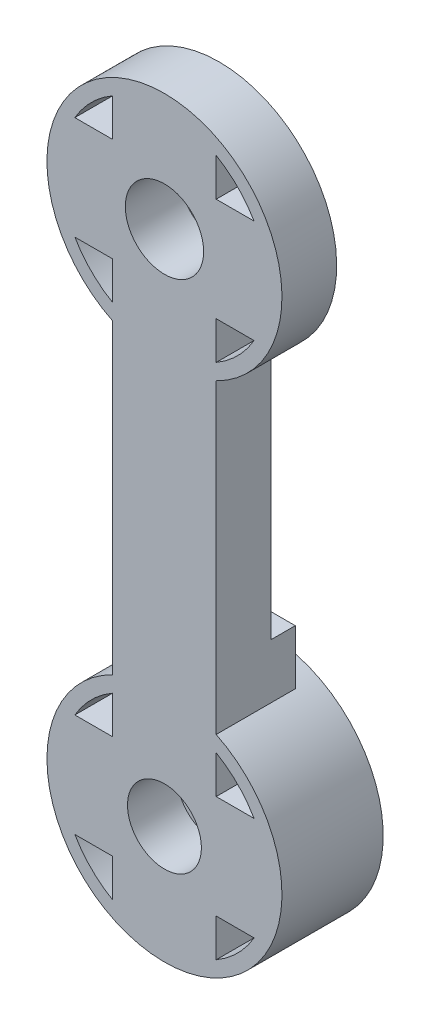
ISO-10303-21;
HEADER;
FILE_DESCRIPTION(('STEP AP214'),'2;1');
FILE_NAME('part.step','',(''),(''),'','','');
FILE_SCHEMA(('AUTOMOTIVE_DESIGN { 1 0 10303 214 1 1 1 1 }'));
ENDSEC;
DATA;
#1=APPLICATION_CONTEXT('core data for automotive mechanical design processes');
#2=APPLICATION_PROTOCOL_DEFINITION('international standard','automotive_design',2000,#1);
#3=PRODUCT_CONTEXT('',#1,'mechanical');
#4=PRODUCT('Part','Part','',(#3));
#5=PRODUCT_RELATED_PRODUCT_CATEGORY('part','',(#4));
#6=PRODUCT_DEFINITION_FORMATION('','',#4);
#7=PRODUCT_DEFINITION_CONTEXT('part definition',#1,'design');
#8=PRODUCT_DEFINITION('design','',#6,#7);
#9=PRODUCT_DEFINITION_SHAPE('','',#8);
#10=(LENGTH_UNIT() NAMED_UNIT(*) SI_UNIT(.MILLI.,.METRE.));
#11=(NAMED_UNIT(*) PLANE_ANGLE_UNIT() SI_UNIT($,.RADIAN.));
#12=(NAMED_UNIT(*) SI_UNIT($,.STERADIAN.) SOLID_ANGLE_UNIT());
#13=UNCERTAINTY_MEASURE_WITH_UNIT(LENGTH_MEASURE(1.E-05),#10,'distance_accuracy_value','');
#14=(GEOMETRIC_REPRESENTATION_CONTEXT(3) GLOBAL_UNCERTAINTY_ASSIGNED_CONTEXT((#13)) GLOBAL_UNIT_ASSIGNED_CONTEXT((#10,
#11,#12)) REPRESENTATION_CONTEXT('',''));
#15=CARTESIAN_POINT('',(0.,0.,0.));
#16=DIRECTION('',(0.,0.,1.));
#17=DIRECTION('',(1.,0.,0.));
#18=AXIS2_PLACEMENT_3D('',#15,#16,#17);
#19=CARTESIAN_POINT('',(0.,-35.,3.));
#20=DIRECTION('',(0.,0.,-1.));
#21=DIRECTION('',(-1.,0.,0.));
#22=AXIS2_PLACEMENT_3D('',#19,#20,#21);
#23=CYLINDRICAL_SURFACE('',#22,7.95);
#24=CARTESIAN_POINT('',(0.,-35.,-3.85));
#25=DIRECTION('',(0.,0.,-1.));
#26=DIRECTION('',(-1.,0.,0.));
#27=AXIS2_PLACEMENT_3D('',#24,#25,#26);
#28=CIRCLE('',#27,7.95);
#29=CARTESIAN_POINT('',(-7.95,-35.,-3.85));
#30=VERTEX_POINT('',#29);
#31=EDGE_CURVE('E285',#30,#30,#28,.T.);
#32=ORIENTED_EDGE('',*,*,#31,.F.);
#33=EDGE_LOOP('',(#32));
#34=FACE_BOUND('',#33,.T.);
#35=CARTESIAN_POINT('',(0.,-35.,-2.35));
#36=DIRECTION('',(0.,0.,-1.));
#37=DIRECTION('',(-1.,0.,0.));
#38=AXIS2_PLACEMENT_3D('',#35,#36,#37);
#39=CIRCLE('',#38,7.95);
#40=CARTESIAN_POINT('',(3.5,-27.8618980113759,-2.35));
#41=VERTEX_POINT('',#40);
#42=CARTESIAN_POINT('',(-3.5,-27.8618980113759,-2.35));
#43=VERTEX_POINT('',#42);
#44=EDGE_CURVE('E267',#41,#43,#39,.F.);
#45=ORIENTED_EDGE('',*,*,#44,.F.);
#46=DIRECTION('',(0.,0.,-1.));
#47=VECTOR('',#46,1.);
#48=CARTESIAN_POINT('',(3.5,-27.8618980113759,3.));
#49=LINE('',#48,#47);
#50=CARTESIAN_POINT('',(3.5,-27.8618980113759,3.));
#51=VERTEX_POINT('',#50);
#52=EDGE_CURVE('E248',#51,#41,#49,.T.);
#53=ORIENTED_EDGE('',*,*,#52,.F.);
#54=CARTESIAN_POINT('',(0.,-35.,3.));
#55=DIRECTION('',(0.,0.,1.));
#56=DIRECTION('',(1.,0.,0.));
#57=AXIS2_PLACEMENT_3D('',#54,#55,#56);
#58=CIRCLE('',#57,7.95);
#59=CARTESIAN_POINT('',(-3.5,-27.8618980113759,3.));
#60=VERTEX_POINT('',#59);
#61=EDGE_CURVE('E427',#51,#60,#58,.F.);
#62=ORIENTED_EDGE('',*,*,#61,.T.);
#63=DIRECTION('',(0.,0.,-1.));
#64=VECTOR('',#63,1.);
#65=CARTESIAN_POINT('',(-3.5,-27.8618980113759,3.));
#66=LINE('',#65,#64);
#67=EDGE_CURVE('E259',#60,#43,#66,.T.);
#68=ORIENTED_EDGE('',*,*,#67,.T.);
#69=EDGE_LOOP('',(#45,#53,#62,#68));
#70=FACE_BOUND('',#69,.T.);
#71=ADVANCED_FACE('F47',(#34,#70),#23,.T.);
#72=CARTESIAN_POINT('',(0.,0.,-0.7));
#73=DIRECTION('',(0.,0.,-1.));
#74=DIRECTION('',(-1.,0.,0.));
#75=AXIS2_PLACEMENT_3D('',#72,#73,#74);
#76=PLANE('',#75);
#77=CARTESIAN_POINT('',(0.,0.,-0.7));
#78=DIRECTION('',(0.,0.,-1.));
#79=DIRECTION('',(-1.,0.,0.));
#80=AXIS2_PLACEMENT_3D('',#77,#78,#79);
#81=CIRCLE('',#80,2.65);
#82=CARTESIAN_POINT('',(-2.65,0.,-0.7));
#83=VERTEX_POINT('',#82);
#84=EDGE_CURVE('E341',#83,#83,#81,.T.);
#85=ORIENTED_EDGE('',*,*,#84,.F.);
#86=EDGE_LOOP('',(#85));
#87=FACE_BOUND('',#86,.T.);
#88=DIRECTION('',(0.,1.,0.));
#89=VECTOR('',#88,1.);
#90=CARTESIAN_POINT('',(-3.5,0.,-0.7));
#91=LINE('',#90,#89);
#92=CARTESIAN_POINT('',(-3.5,3.5,-0.7));
#93=VERTEX_POINT('',#92);
#94=CARTESIAN_POINT('',(-3.5,6.06217782649107,-0.7));
#95=VERTEX_POINT('',#94);
#96=EDGE_CURVE('E376',#93,#95,#91,.T.);
#97=ORIENTED_EDGE('',*,*,#96,.T.);
#98=CARTESIAN_POINT('',(0.,0.,-0.7));
#99=DIRECTION('',(0.,0.,1.));
#100=DIRECTION('',(1.,0.,0.));
#101=AXIS2_PLACEMENT_3D('',#98,#99,#100);
#102=CIRCLE('',#101,7.);
#103=CARTESIAN_POINT('',(-6.06217782649107,3.5,-0.7));
#104=VERTEX_POINT('',#103);
#105=EDGE_CURVE('E375',#95,#104,#102,.T.);
#106=ORIENTED_EDGE('',*,*,#105,.T.);
#107=DIRECTION('',(-1.,0.,0.));
#108=VECTOR('',#107,1.);
#109=CARTESIAN_POINT('',(0.,3.5,-0.7));
#110=LINE('',#109,#108);
#111=EDGE_CURVE('E379',#93,#104,#110,.T.);
#112=ORIENTED_EDGE('',*,*,#111,.F.);
#113=EDGE_LOOP('',(#97,#106,#112));
#114=FACE_BOUND('',#113,.T.);
#115=DIRECTION('',(0.,-1.,0.));
#116=VECTOR('',#115,1.);
#117=CARTESIAN_POINT('',(3.5,0.,-0.7));
#118=LINE('',#117,#116);
#119=CARTESIAN_POINT('',(3.5,-3.5,-0.7));
#120=VERTEX_POINT('',#119);
#121=CARTESIAN_POINT('',(3.5,-6.06217782649107,-0.7));
#122=VERTEX_POINT('',#121);
#123=EDGE_CURVE('E73',#120,#122,#118,.T.);
#124=ORIENTED_EDGE('',*,*,#123,.T.);
#125=CARTESIAN_POINT('',(6.06217782649107,-3.5,-0.7));
#126=VERTEX_POINT('',#125);
#127=EDGE_CURVE('E357',#122,#126,#102,.T.);
#128=ORIENTED_EDGE('',*,*,#127,.T.);
#129=DIRECTION('',(1.,0.,0.));
#130=VECTOR('',#129,1.);
#131=CARTESIAN_POINT('',(0.,-3.5,-0.7));
#132=LINE('',#131,#130);
#133=EDGE_CURVE('E360',#120,#126,#132,.T.);
#134=ORIENTED_EDGE('',*,*,#133,.F.);
#135=EDGE_LOOP('',(#124,#128,#134));
#136=FACE_BOUND('',#135,.T.);
#137=DIRECTION('',(-1.,0.,0.));
#138=VECTOR('',#137,1.);
#139=CARTESIAN_POINT('',(0.,-3.5,-0.7));
#140=LINE('',#139,#138);
#141=CARTESIAN_POINT('',(-3.5,-3.5,-0.7));
#142=VERTEX_POINT('',#141);
#143=CARTESIAN_POINT('',(-6.06217782649107,-3.5,-0.7));
#144=VERTEX_POINT('',#143);
#145=EDGE_CURVE('E372',#142,#144,#140,.T.);
#146=ORIENTED_EDGE('',*,*,#145,.T.);
#147=CARTESIAN_POINT('',(-3.5,-6.06217782649107,-0.7));
#148=VERTEX_POINT('',#147);
#149=EDGE_CURVE('E362',#144,#148,#102,.T.);
#150=ORIENTED_EDGE('',*,*,#149,.T.);
#151=DIRECTION('',(0.,-1.,0.));
#152=VECTOR('',#151,1.);
#153=CARTESIAN_POINT('',(-3.5,0.,-0.7));
#154=LINE('',#153,#152);
#155=EDGE_CURVE('E368',#142,#148,#154,.T.);
#156=ORIENTED_EDGE('',*,*,#155,.F.);
#157=EDGE_LOOP('',(#146,#150,#156));
#158=FACE_BOUND('',#157,.T.);
#159=DIRECTION('',(1.,0.,0.));
#160=VECTOR('',#159,1.);
#161=CARTESIAN_POINT('',(0.,3.5,-0.7));
#162=LINE('',#161,#160);
#163=CARTESIAN_POINT('',(3.5,3.5,-0.7));
#164=VERTEX_POINT('',#163);
#165=CARTESIAN_POINT('',(6.06217782649107,3.5,-0.7));
#166=VERTEX_POINT('',#165);
#167=EDGE_CURVE('E387',#164,#166,#162,.T.);
#168=ORIENTED_EDGE('',*,*,#167,.T.);
#169=CARTESIAN_POINT('',(3.5,6.06217782649107,-0.7));
#170=VERTEX_POINT('',#169);
#171=EDGE_CURVE('E361',#166,#170,#102,.T.);
#172=ORIENTED_EDGE('',*,*,#171,.T.);
#173=DIRECTION('',(0.,1.,0.));
#174=VECTOR('',#173,1.);
#175=CARTESIAN_POINT('',(3.5,0.,-0.7));
#176=LINE('',#175,#174);
#177=EDGE_CURVE('E383',#164,#170,#176,.T.);
#178=ORIENTED_EDGE('',*,*,#177,.F.);
#179=EDGE_LOOP('',(#168,#172,#178));
#180=FACE_BOUND('',#179,.T.);
#181=DIRECTION('',(0.,-1.,0.));
#182=VECTOR('',#181,1.);
#183=CARTESIAN_POINT('',(3.5,0.,-0.7));
#184=LINE('',#183,#182);
#185=CARTESIAN_POINT('',(3.5,-7.13810198862415,-0.7));
#186=VERTEX_POINT('',#185);
#187=CARTESIAN_POINT('',(3.5,-24.1618980113759,-0.7));
#188=VERTEX_POINT('',#187);
#189=EDGE_CURVE('E390',#186,#188,#184,.T.);
#190=ORIENTED_EDGE('',*,*,#189,.T.);
#191=DIRECTION('',(-1.,0.,0.));
#192=VECTOR('',#191,1.);
#193=CARTESIAN_POINT('',(0.,-24.1618980113759,-0.7));
#194=LINE('',#193,#192);
#195=CARTESIAN_POINT('',(-3.5,-24.1618980113759,-0.7));
#196=VERTEX_POINT('',#195);
#197=EDGE_CURVE('E345',#188,#196,#194,.T.);
#198=ORIENTED_EDGE('',*,*,#197,.T.);
#199=DIRECTION('',(0.,1.,0.));
#200=VECTOR('',#199,1.);
#201=CARTESIAN_POINT('',(-3.5,0.,-0.7));
#202=LINE('',#201,#200);
#203=CARTESIAN_POINT('',(-3.5,-7.13810198862415,-0.7));
#204=VERTEX_POINT('',#203);
#205=EDGE_CURVE('E394',#196,#204,#202,.T.);
#206=ORIENTED_EDGE('',*,*,#205,.T.);
#207=CARTESIAN_POINT('',(0.,0.,-0.7));
#208=DIRECTION('',(0.,0.,1.));
#209=DIRECTION('',(1.,0.,0.));
#210=AXIS2_PLACEMENT_3D('',#207,#208,#209);
#211=CIRCLE('',#210,7.95);
#212=EDGE_CURVE('E353',#186,#204,#211,.T.);
#213=ORIENTED_EDGE('',*,*,#212,.F.);
#214=EDGE_LOOP('',(#190,#198,#206,#213));
#215=FACE_BOUND('',#214,.T.);
#216=ADVANCED_FACE('F650',(#87,#114,#136,#158,#180,#215),#76,.T.);
#217=CARTESIAN_POINT('',(0.,0.,3.));
#218=DIRECTION('',(0.,0.,-1.));
#219=DIRECTION('',(-1.,0.,0.));
#220=AXIS2_PLACEMENT_3D('',#217,#218,#219);
#221=CYLINDRICAL_SURFACE('',#220,7.);
#222=ORIENTED_EDGE('',*,*,#171,.F.);
#223=DIRECTION('',(0.,0.,-1.));
#224=VECTOR('',#223,1.);
#225=CARTESIAN_POINT('',(6.06217782649107,3.5,3.));
#226=LINE('',#225,#224);
#227=CARTESIAN_POINT('',(6.06217782649107,3.5,3.));
#228=VERTEX_POINT('',#227);
#229=EDGE_CURVE('E11',#228,#166,#226,.T.);
#230=ORIENTED_EDGE('',*,*,#229,.F.);
#231=CARTESIAN_POINT('',(0.,0.,3.));
#232=DIRECTION('',(0.,0.,1.));
#233=DIRECTION('',(1.,0.,0.));
#234=AXIS2_PLACEMENT_3D('',#231,#232,#233);
#235=CIRCLE('',#234,7.);
#236=CARTESIAN_POINT('',(3.5,6.06217782649107,3.));
#237=VERTEX_POINT('',#236);
#238=EDGE_CURVE('E485',#228,#237,#235,.T.);
#239=ORIENTED_EDGE('',*,*,#238,.T.);
#240=DIRECTION('',(0.,0.,-1.));
#241=VECTOR('',#240,1.);
#242=CARTESIAN_POINT('',(3.5,6.06217782649107,3.));
#243=LINE('',#242,#241);
#244=EDGE_CURVE('E497',#237,#170,#243,.T.);
#245=ORIENTED_EDGE('',*,*,#244,.T.);
#246=EDGE_LOOP('',(#222,#230,#239,#245));
#247=FACE_BOUND('',#246,.T.);
#248=ADVANCED_FACE('F641',(#247),#221,.F.);
#249=ORIENTED_EDGE('',*,*,#105,.F.);
#250=DIRECTION('',(0.,0.,-1.));
#251=VECTOR('',#250,1.);
#252=CARTESIAN_POINT('',(-3.5,6.06217782649107,3.));
#253=LINE('',#252,#251);
#254=CARTESIAN_POINT('',(-3.5,6.06217782649107,3.));
#255=VERTEX_POINT('',#254);
#256=EDGE_CURVE('E509',#255,#95,#253,.T.);
#257=ORIENTED_EDGE('',*,*,#256,.F.);
#258=CARTESIAN_POINT('',(-6.06217782649107,3.5,3.));
#259=VERTEX_POINT('',#258);
#260=EDGE_CURVE('E480',#255,#259,#235,.T.);
#261=ORIENTED_EDGE('',*,*,#260,.T.);
#262=DIRECTION('',(0.,0.,-1.));
#263=VECTOR('',#262,1.);
#264=CARTESIAN_POINT('',(-6.06217782649107,3.5,3.));
#265=LINE('',#264,#263);
#266=EDGE_CURVE('E501',#259,#104,#265,.T.);
#267=ORIENTED_EDGE('',*,*,#266,.T.);
#268=EDGE_LOOP('',(#249,#257,#261,#267));
#269=FACE_BOUND('',#268,.T.);
#270=ADVANCED_FACE('F1038',(#269),#221,.F.);
#271=ORIENTED_EDGE('',*,*,#149,.F.);
#272=DIRECTION('',(0.,0.,-1.));
#273=VECTOR('',#272,1.);
#274=CARTESIAN_POINT('',(-6.06217782649107,-3.5,3.));
#275=LINE('',#274,#273);
#276=CARTESIAN_POINT('',(-6.06217782649107,-3.5,3.));
#277=VERTEX_POINT('',#276);
#278=EDGE_CURVE('E517',#277,#144,#275,.T.);
#279=ORIENTED_EDGE('',*,*,#278,.F.);
#280=CARTESIAN_POINT('',(0.,0.,3.));
#281=DIRECTION('',(0.,0.,1.));
#282=DIRECTION('',(1.,0.,0.));
#283=AXIS2_PLACEMENT_3D('',#280,#281,#282);
#284=CIRCLE('',#283,7.);
#285=CARTESIAN_POINT('',(-3.5,-6.06217782649107,3.));
#286=VERTEX_POINT('',#285);
#287=EDGE_CURVE('E473',#277,#286,#284,.T.);
#288=ORIENTED_EDGE('',*,*,#287,.T.);
#289=DIRECTION('',(0.,0.,-1.));
#290=VECTOR('',#289,1.);
#291=CARTESIAN_POINT('',(-3.5,-6.06217782649107,3.));
#292=LINE('',#291,#290);
#293=EDGE_CURVE('E521',#286,#148,#292,.T.);
#294=ORIENTED_EDGE('',*,*,#293,.T.);
#295=EDGE_LOOP('',(#271,#279,#288,#294));
#296=FACE_BOUND('',#295,.T.);
#297=ADVANCED_FACE('F657',(#296),#221,.F.);
#298=CARTESIAN_POINT('',(0.,0.,3.));
#299=DIRECTION('',(0.,0.,-1.));
#300=DIRECTION('',(-1.,0.,0.));
#301=AXIS2_PLACEMENT_3D('',#298,#299,#300);
#302=CYLINDRICAL_SURFACE('',#301,7.95);
#303=ORIENTED_EDGE('',*,*,#212,.T.);
#304=DIRECTION('',(0.,0.,-1.));
#305=VECTOR('',#304,1.);
#306=CARTESIAN_POINT('',(-3.5,-7.13810198862415,3.));
#307=LINE('',#306,#305);
#308=CARTESIAN_POINT('',(-3.5,-7.13810198862415,3.));
#309=VERTEX_POINT('',#308);
#310=EDGE_CURVE('E558',#309,#204,#307,.T.);
#311=ORIENTED_EDGE('',*,*,#310,.F.);
#312=CARTESIAN_POINT('',(0.,0.,3.));
#313=DIRECTION('',(0.,0.,1.));
#314=DIRECTION('',(1.,0.,0.));
#315=AXIS2_PLACEMENT_3D('',#312,#313,#314);
#316=CIRCLE('',#315,7.95);
#317=CARTESIAN_POINT('',(3.5,-7.13810198862415,3.));
#318=VERTEX_POINT('',#317);
#319=EDGE_CURVE('E432',#318,#309,#316,.T.);
#320=ORIENTED_EDGE('',*,*,#319,.F.);
#321=DIRECTION('',(0.,0.,-1.));
#322=VECTOR('',#321,1.);
#323=CARTESIAN_POINT('',(3.5,-7.13810198862415,3.));
#324=LINE('',#323,#322);
#325=EDGE_CURVE('E260',#318,#186,#324,.T.);
#326=ORIENTED_EDGE('',*,*,#325,.T.);
#327=EDGE_LOOP('',(#303,#311,#320,#326));
#328=FACE_BOUND('',#327,.T.);
#329=ADVANCED_FACE('F766',(#328),#302,.T.);
#330=CARTESIAN_POINT('',(0.,-35.,3.));
#331=DIRECTION('',(0.,0.,-1.));
#332=DIRECTION('',(-1.,0.,0.));
#333=AXIS2_PLACEMENT_3D('',#330,#331,#332);
#334=CYLINDRICAL_SURFACE('',#333,1.5);
#335=CARTESIAN_POINT('',(0.,-35.,-0.35));
#336=DIRECTION('',(0.,0.,1.));
#337=DIRECTION('',(1.,0.,0.));
#338=AXIS2_PLACEMENT_3D('',#335,#336,#337);
#339=CIRCLE('',#338,1.5);
#340=CARTESIAN_POINT('',(1.5,-35.,-0.35));
#341=VERTEX_POINT('',#340);
#342=EDGE_CURVE('E51',#341,#341,#339,.F.);
#343=ORIENTED_EDGE('',*,*,#342,.F.);
#344=EDGE_LOOP('',(#343));
#345=FACE_BOUND('',#344,.T.);
#346=CARTESIAN_POINT('',(0.,-35.,-3.85));
#347=DIRECTION('',(0.,0.,-1.));
#348=DIRECTION('',(-1.,0.,0.));
#349=AXIS2_PLACEMENT_3D('',#346,#347,#348);
#350=CIRCLE('',#349,1.5);
#351=CARTESIAN_POINT('',(-1.5,-35.,-3.85));
#352=VERTEX_POINT('',#351);
#353=EDGE_CURVE('E281',#352,#352,#350,.F.);
#354=ORIENTED_EDGE('',*,*,#353,.F.);
#355=EDGE_LOOP('',(#354));
#356=FACE_BOUND('',#355,.T.);
#357=ADVANCED_FACE('F757',(#345,#356),#334,.F.);
#358=CARTESIAN_POINT('',(0.,-31.5,3.));
#359=DIRECTION('',(0.,-1.,0.));
#360=DIRECTION('',(0.,0.,-1.));
#361=AXIS2_PLACEMENT_3D('',#358,#359,#360);
#362=PLANE('',#361);
#363=DIRECTION('',(0.,0.,-1.));
#364=VECTOR('',#363,1.);
#365=CARTESIAN_POINT('',(6.06217782649107,-31.5,3.));
#366=LINE('',#365,#364);
#367=CARTESIAN_POINT('',(6.06217782649107,-31.5,3.));
#368=VERTEX_POINT('',#367);
#369=CARTESIAN_POINT('',(6.06217782649107,-31.5,-3.85));
#370=VERTEX_POINT('',#369);
#371=EDGE_CURVE('E529',#368,#370,#366,.T.);
#372=ORIENTED_EDGE('',*,*,#371,.T.);
#373=DIRECTION('',(1.,0.,0.));
#374=VECTOR('',#373,1.);
#375=CARTESIAN_POINT('',(0.,-31.5,-3.85));
#376=LINE('',#375,#374);
#377=CARTESIAN_POINT('',(3.5,-31.5,-3.85));
#378=VERTEX_POINT('',#377);
#379=EDGE_CURVE('E313',#378,#370,#376,.T.);
#380=ORIENTED_EDGE('',*,*,#379,.F.);
#381=DIRECTION('',(0.,0.,-1.));
#382=VECTOR('',#381,1.);
#383=CARTESIAN_POINT('',(3.5,-31.5,3.));
#384=LINE('',#383,#382);
#385=CARTESIAN_POINT('',(3.5,-31.5,3.));
#386=VERTEX_POINT('',#385);
#387=EDGE_CURVE('E522',#386,#378,#384,.T.);
#388=ORIENTED_EDGE('',*,*,#387,.F.);
#389=DIRECTION('',(-1.,0.,0.));
#390=VECTOR('',#389,1.);
#391=CARTESIAN_POINT('',(0.,-31.5,3.));
#392=LINE('',#391,#390);
#393=EDGE_CURVE('E456',#368,#386,#392,.T.);
#394=ORIENTED_EDGE('',*,*,#393,.F.);
#395=EDGE_LOOP('',(#372,#380,#388,#394));
#396=FACE_BOUND('',#395,.T.);
#397=ADVANCED_FACE('F748',(#396),#362,.F.);
#398=CARTESIAN_POINT('',(3.5,0.,3.));
#399=DIRECTION('',(1.,0.,0.));
#400=DIRECTION('',(0.,1.,0.));
#401=AXIS2_PLACEMENT_3D('',#398,#399,#400);
#402=PLANE('',#401);
#403=ORIENTED_EDGE('',*,*,#387,.T.);
#404=DIRECTION('',(0.,-1.,0.));
#405=VECTOR('',#404,1.);
#406=CARTESIAN_POINT('',(3.5,0.,-3.85));
#407=LINE('',#406,#405);
#408=CARTESIAN_POINT('',(3.5,-28.9378221735089,-3.85));
#409=VERTEX_POINT('',#408);
#410=EDGE_CURVE('E321',#409,#378,#407,.T.);
#411=ORIENTED_EDGE('',*,*,#410,.F.);
#412=DIRECTION('',(0.,0.,-1.));
#413=VECTOR('',#412,1.);
#414=CARTESIAN_POINT('',(3.5,-28.9378221735089,3.));
#415=LINE('',#414,#413);
#416=CARTESIAN_POINT('',(3.5,-28.9378221735089,3.));
#417=VERTEX_POINT('',#416);
#418=EDGE_CURVE('E532',#417,#409,#415,.T.);
#419=ORIENTED_EDGE('',*,*,#418,.F.);
#420=DIRECTION('',(0.,-1.,0.));
#421=VECTOR('',#420,1.);
#422=CARTESIAN_POINT('',(3.5,0.,3.));
#423=LINE('',#422,#421);
#424=EDGE_CURVE('E459',#417,#386,#423,.T.);
#425=ORIENTED_EDGE('',*,*,#424,.T.);
#426=EDGE_LOOP('',(#403,#411,#419,#425));
#427=FACE_BOUND('',#426,.T.);
#428=ADVANCED_FACE('F739',(#427),#402,.T.);
#429=CARTESIAN_POINT('',(0.,-31.5,3.));
#430=DIRECTION('',(0.,-1.,0.));
#431=DIRECTION('',(0.,0.,-1.));
#432=AXIS2_PLACEMENT_3D('',#429,#430,#431);
#433=PLANE('',#432);
#434=DIRECTION('',(0.,0.,-1.));
#435=VECTOR('',#434,1.);
#436=CARTESIAN_POINT('',(-3.5,-31.5,3.));
#437=LINE('',#436,#435);
#438=CARTESIAN_POINT('',(-3.5,-31.5,3.));
#439=VERTEX_POINT('',#438);
#440=CARTESIAN_POINT('',(-3.5,-31.5,-3.85));
#441=VERTEX_POINT('',#440);
#442=EDGE_CURVE('E550',#439,#441,#437,.T.);
#443=ORIENTED_EDGE('',*,*,#442,.T.);
#444=DIRECTION('',(1.,0.,0.));
#445=VECTOR('',#444,1.);
#446=CARTESIAN_POINT('',(0.,-31.5,-3.85));
#447=LINE('',#446,#445);
#448=CARTESIAN_POINT('',(-6.06217782649107,-31.5,-3.85));
#449=VERTEX_POINT('',#448);
#450=EDGE_CURVE('E333',#449,#441,#447,.T.);
#451=ORIENTED_EDGE('',*,*,#450,.F.);
#452=DIRECTION('',(0.,0.,-1.));
#453=VECTOR('',#452,1.);
#454=CARTESIAN_POINT('',(-6.06217782649107,-31.5,3.));
#455=LINE('',#454,#453);
#456=CARTESIAN_POINT('',(-6.06217782649107,-31.5,3.));
#457=VERTEX_POINT('',#456);
#458=EDGE_CURVE('E543',#457,#449,#455,.T.);
#459=ORIENTED_EDGE('',*,*,#458,.F.);
#460=DIRECTION('',(-1.,0.,0.));
#461=VECTOR('',#460,1.);
#462=CARTESIAN_POINT('',(0.,-31.5,3.));
#463=LINE('',#462,#461);
#464=EDGE_CURVE('E435',#439,#457,#463,.T.);
#465=ORIENTED_EDGE('',*,*,#464,.F.);
#466=EDGE_LOOP('',(#443,#451,#459,#465));
#467=FACE_BOUND('',#466,.T.);
#468=ADVANCED_FACE('F730',(#467),#433,.F.);
#469=CARTESIAN_POINT('',(0.,-35.,3.));
#470=DIRECTION('',(0.,0.,-1.));
#471=DIRECTION('',(-1.,0.,0.));
#472=AXIS2_PLACEMENT_3D('',#469,#470,#471);
#473=CYLINDRICAL_SURFACE('',#472,7.);
#474=ORIENTED_EDGE('',*,*,#458,.T.);
#475=CARTESIAN_POINT('',(0.,-35.,-3.85));
#476=DIRECTION('',(0.,0.,-1.));
#477=DIRECTION('',(-1.,0.,0.));
#478=AXIS2_PLACEMENT_3D('',#475,#476,#477);
#479=CIRCLE('',#478,7.);
#480=CARTESIAN_POINT('',(-3.5,-28.9378221735089,-3.85));
#481=VERTEX_POINT('',#480);
#482=EDGE_CURVE('E329',#481,#449,#479,.F.);
#483=ORIENTED_EDGE('',*,*,#482,.F.);
#484=DIRECTION('',(0.,0.,-1.));
#485=VECTOR('',#484,1.);
#486=CARTESIAN_POINT('',(-3.5,-28.9378221735089,3.));
#487=LINE('',#486,#485);
#488=CARTESIAN_POINT('',(-3.5,-28.9378221735089,3.));
#489=VERTEX_POINT('',#488);
#490=EDGE_CURVE('E553',#489,#481,#487,.T.);
#491=ORIENTED_EDGE('',*,*,#490,.F.);
#492=CARTESIAN_POINT('',(0.,-35.,3.));
#493=DIRECTION('',(0.,0.,1.));
#494=DIRECTION('',(1.,0.,0.));
#495=AXIS2_PLACEMENT_3D('',#492,#493,#494);
#496=CIRCLE('',#495,7.);
#497=EDGE_CURVE('E439',#457,#489,#496,.F.);
#498=ORIENTED_EDGE('',*,*,#497,.F.);
#499=EDGE_LOOP('',(#474,#483,#491,#498));
#500=FACE_BOUND('',#499,.T.);
#501=ADVANCED_FACE('F701',(#500),#473,.F.);
#502=CARTESIAN_POINT('',(3.50000000000003,0.,3.));
#503=DIRECTION('',(1.,0.,0.));
#504=DIRECTION('',(0.,1.,0.));
#505=AXIS2_PLACEMENT_3D('',#502,#503,#504);
#506=PLANE('',#505);
#507=DIRECTION('',(0.,0.,-1.));
#508=VECTOR('',#507,1.);
#509=CARTESIAN_POINT('',(3.5,-41.0621778264911,3.));
#510=LINE('',#509,#508);
#511=CARTESIAN_POINT('',(3.5,-41.0621778264911,3.));
#512=VERTEX_POINT('',#511);
#513=CARTESIAN_POINT('',(3.5,-41.0621778264911,-3.85));
#514=VERTEX_POINT('',#513);
#515=EDGE_CURVE('E568',#512,#514,#510,.T.);
#516=ORIENTED_EDGE('',*,*,#515,.T.);
#517=DIRECTION('',(0.,-1.,0.));
#518=VECTOR('',#517,1.);
#519=CARTESIAN_POINT('',(3.50000000000003,0.,-3.85));
#520=LINE('',#519,#518);
#521=CARTESIAN_POINT('',(3.5,-38.5,-3.85));
#522=VERTEX_POINT('',#521);
#523=EDGE_CURVE('E301',#522,#514,#520,.T.);
#524=ORIENTED_EDGE('',*,*,#523,.F.);
#525=DIRECTION('',(0.,0.,-1.));
#526=VECTOR('',#525,1.);
#527=CARTESIAN_POINT('',(3.5,-38.5,3.));
#528=LINE('',#527,#526);
#529=CARTESIAN_POINT('',(3.5,-38.5,3.));
#530=VERTEX_POINT('',#529);
#531=EDGE_CURVE('E562',#530,#522,#528,.T.);
#532=ORIENTED_EDGE('',*,*,#531,.F.);
#533=DIRECTION('',(0.,-1.,0.));
#534=VECTOR('',#533,1.);
#535=CARTESIAN_POINT('',(3.50000000000003,0.,3.));
#536=LINE('',#535,#534);
#537=EDGE_CURVE('E415',#530,#512,#536,.T.);
#538=ORIENTED_EDGE('',*,*,#537,.T.);
#539=EDGE_LOOP('',(#516,#524,#532,#538));
#540=FACE_BOUND('',#539,.T.);
#541=ADVANCED_FACE('F698',(#540),#506,.T.);
#542=CARTESIAN_POINT('',(0.,-38.5,3.));
#543=DIRECTION('',(0.,-1.,0.));
#544=DIRECTION('',(0.,0.,-1.));
#545=AXIS2_PLACEMENT_3D('',#542,#543,#544);
#546=PLANE('',#545);
#547=ORIENTED_EDGE('',*,*,#531,.T.);
#548=DIRECTION('',(-1.,0.,0.));
#549=VECTOR('',#548,1.);
#550=CARTESIAN_POINT('',(0.,-38.5,-3.85));
#551=LINE('',#550,#549);
#552=CARTESIAN_POINT('',(6.06217782649107,-38.5,-3.85));
#553=VERTEX_POINT('',#552);
#554=EDGE_CURVE('E309',#553,#522,#551,.T.);
#555=ORIENTED_EDGE('',*,*,#554,.F.);
#556=DIRECTION('',(0.,0.,-1.));
#557=VECTOR('',#556,1.);
#558=CARTESIAN_POINT('',(6.06217782649107,-38.5,3.));
#559=LINE('',#558,#557);
#560=CARTESIAN_POINT('',(6.06217782649107,-38.5,3.));
#561=VERTEX_POINT('',#560);
#562=EDGE_CURVE('E571',#561,#553,#559,.T.);
#563=ORIENTED_EDGE('',*,*,#562,.F.);
#564=DIRECTION('',(-1.,0.,0.));
#565=VECTOR('',#564,1.);
#566=CARTESIAN_POINT('',(0.,-38.5,3.));
#567=LINE('',#566,#565);
#568=EDGE_CURVE('E420',#561,#530,#567,.T.);
#569=ORIENTED_EDGE('',*,*,#568,.T.);
#570=EDGE_LOOP('',(#547,#555,#563,#569));
#571=FACE_BOUND('',#570,.T.);
#572=ADVANCED_FACE('F695',(#571),#546,.T.);
#573=CARTESIAN_POINT('',(0.,-38.5,3.));
#574=DIRECTION('',(0.,-1.,0.));
#575=DIRECTION('',(0.,0.,-1.));
#576=AXIS2_PLACEMENT_3D('',#573,#574,#575);
#577=PLANE('',#576);
#578=DIRECTION('',(0.,0.,-1.));
#579=VECTOR('',#578,1.);
#580=CARTESIAN_POINT('',(-6.06217782649107,-38.5,3.));
#581=LINE('',#580,#579);
#582=CARTESIAN_POINT('',(-6.06217782649107,-38.5,3.));
#583=VERTEX_POINT('',#582);
#584=CARTESIAN_POINT('',(-6.06217782649107,-38.5,-3.85));
#585=VERTEX_POINT('',#584);
#586=EDGE_CURVE('E496',#583,#585,#581,.T.);
#587=ORIENTED_EDGE('',*,*,#586,.T.);
#588=DIRECTION('',(-1.,0.,0.));
#589=VECTOR('',#588,1.);
#590=CARTESIAN_POINT('',(0.,-38.5,-3.85));
#591=LINE('',#590,#589);
#592=CARTESIAN_POINT('',(-3.5,-38.5,-3.85));
#593=VERTEX_POINT('',#592);
#594=EDGE_CURVE('E293',#593,#585,#591,.T.);
#595=ORIENTED_EDGE('',*,*,#594,.F.);
#596=DIRECTION('',(0.,0.,-1.));
#597=VECTOR('',#596,1.);
#598=CARTESIAN_POINT('',(-3.5,-38.5,3.));
#599=LINE('',#598,#597);
#600=CARTESIAN_POINT('',(-3.5,-38.5,3.));
#601=VERTEX_POINT('',#600);
#602=EDGE_CURVE('E572',#601,#593,#599,.T.);
#603=ORIENTED_EDGE('',*,*,#602,.F.);
#604=DIRECTION('',(-1.,0.,0.));
#605=VECTOR('',#604,1.);
#606=CARTESIAN_POINT('',(0.,-38.5,3.));
#607=LINE('',#606,#605);
#608=EDGE_CURVE('E405',#601,#583,#607,.T.);
#609=ORIENTED_EDGE('',*,*,#608,.T.);
#610=EDGE_LOOP('',(#587,#595,#603,#609));
#611=FACE_BOUND('',#610,.T.);
#612=ADVANCED_FACE('F49',(#611),#577,.T.);
#613=CARTESIAN_POINT('',(-3.5,0.,3.));
#614=DIRECTION('',(1.,0.,0.));
#615=DIRECTION('',(0.,0.,-1.));
#616=AXIS2_PLACEMENT_3D('',#613,#614,#615);
#617=PLANE('',#616);
#618=ORIENTED_EDGE('',*,*,#602,.T.);
#619=DIRECTION('',(0.,1.,0.));
#620=VECTOR('',#619,1.);
#621=CARTESIAN_POINT('',(-3.5,0.,-3.85));
#622=LINE('',#621,#620);
#623=CARTESIAN_POINT('',(-3.5,-41.0621778264911,-3.85));
#624=VERTEX_POINT('',#623);
#625=EDGE_CURVE('E289',#624,#593,#622,.T.);
#626=ORIENTED_EDGE('',*,*,#625,.F.);
#627=DIRECTION('',(0.,0.,-1.));
#628=VECTOR('',#627,1.);
#629=CARTESIAN_POINT('',(-3.5,-41.0621778264911,3.));
#630=LINE('',#629,#628);
#631=CARTESIAN_POINT('',(-3.5,-41.0621778264911,3.));
#632=VERTEX_POINT('',#631);
#633=EDGE_CURVE('E579',#632,#624,#630,.T.);
#634=ORIENTED_EDGE('',*,*,#633,.F.);
#635=DIRECTION('',(0.,-1.,0.));
#636=VECTOR('',#635,1.);
#637=CARTESIAN_POINT('',(-3.5,0.,3.));
#638=LINE('',#637,#636);
#639=EDGE_CURVE('E409',#601,#632,#638,.T.);
#640=ORIENTED_EDGE('',*,*,#639,.F.);
#641=EDGE_LOOP('',(#618,#626,#634,#640));
#642=FACE_BOUND('',#641,.T.);
#643=ADVANCED_FACE('F586',(#642),#617,.F.);
#644=CARTESIAN_POINT('',(0.,-35.,3.));
#645=DIRECTION('',(0.,0.,-1.));
#646=DIRECTION('',(-1.,0.,0.));
#647=AXIS2_PLACEMENT_3D('',#644,#645,#646);
#648=CYLINDRICAL_SURFACE('',#647,7.);
#649=ORIENTED_EDGE('',*,*,#418,.T.);
#650=CARTESIAN_POINT('',(0.,-35.,-3.85));
#651=DIRECTION('',(0.,0.,-1.));
#652=DIRECTION('',(-1.,0.,0.));
#653=AXIS2_PLACEMENT_3D('',#650,#651,#652);
#654=CIRCLE('',#653,7.);
#655=EDGE_CURVE('E317',#370,#409,#654,.F.);
#656=ORIENTED_EDGE('',*,*,#655,.F.);
#657=ORIENTED_EDGE('',*,*,#371,.F.);
#658=CARTESIAN_POINT('',(0.,-35.,3.));
#659=DIRECTION('',(0.,0.,1.));
#660=DIRECTION('',(1.,0.,0.));
#661=AXIS2_PLACEMENT_3D('',#658,#659,#660);
#662=CIRCLE('',#661,7.);
#663=EDGE_CURVE('E463',#417,#368,#662,.F.);
#664=ORIENTED_EDGE('',*,*,#663,.F.);
#665=EDGE_LOOP('',(#649,#656,#657,#664));
#666=FACE_BOUND('',#665,.T.);
#667=ADVANCED_FACE('F704',(#666),#648,.F.);
#668=CARTESIAN_POINT('',(-3.5,0.,3.));
#669=DIRECTION('',(1.,0.,0.));
#670=DIRECTION('',(0.,0.,-1.));
#671=AXIS2_PLACEMENT_3D('',#668,#669,#670);
#672=PLANE('',#671);
#673=ORIENTED_EDGE('',*,*,#490,.T.);
#674=DIRECTION('',(0.,1.,0.));
#675=VECTOR('',#674,1.);
#676=CARTESIAN_POINT('',(-3.5,0.,-3.85));
#677=LINE('',#676,#675);
#678=EDGE_CURVE('E325',#441,#481,#677,.T.);
#679=ORIENTED_EDGE('',*,*,#678,.F.);
#680=ORIENTED_EDGE('',*,*,#442,.F.);
#681=DIRECTION('',(0.,-1.,0.));
#682=VECTOR('',#681,1.);
#683=CARTESIAN_POINT('',(-3.5,0.,3.));
#684=LINE('',#683,#682);
#685=EDGE_CURVE('E442',#489,#439,#684,.T.);
#686=ORIENTED_EDGE('',*,*,#685,.F.);
#687=EDGE_LOOP('',(#673,#679,#680,#686));
#688=FACE_BOUND('',#687,.T.);
#689=ADVANCED_FACE('F693',(#688),#672,.F.);
#690=CARTESIAN_POINT('',(0.,-35.,3.));
#691=DIRECTION('',(0.,0.,-1.));
#692=DIRECTION('',(-1.,0.,0.));
#693=AXIS2_PLACEMENT_3D('',#690,#691,#692);
#694=CYLINDRICAL_SURFACE('',#693,7.);
#695=ORIENTED_EDGE('',*,*,#562,.T.);
#696=CARTESIAN_POINT('',(0.,-35.,-3.85));
#697=DIRECTION('',(0.,0.,-1.));
#698=DIRECTION('',(-1.,0.,0.));
#699=AXIS2_PLACEMENT_3D('',#696,#697,#698);
#700=CIRCLE('',#699,7.);
#701=EDGE_CURVE('E305',#514,#553,#700,.F.);
#702=ORIENTED_EDGE('',*,*,#701,.F.);
#703=ORIENTED_EDGE('',*,*,#515,.F.);
#704=CARTESIAN_POINT('',(0.,-35.,3.));
#705=DIRECTION('',(0.,0.,1.));
#706=DIRECTION('',(1.,0.,0.));
#707=AXIS2_PLACEMENT_3D('',#704,#705,#706);
#708=CIRCLE('',#707,7.);
#709=EDGE_CURVE('E416',#561,#512,#708,.F.);
#710=ORIENTED_EDGE('',*,*,#709,.F.);
#711=EDGE_LOOP('',(#695,#702,#703,#710));
#712=FACE_BOUND('',#711,.T.);
#713=ADVANCED_FACE('F690',(#712),#694,.F.);
#714=ORIENTED_EDGE('',*,*,#633,.T.);
#715=CARTESIAN_POINT('',(0.,-35.,-3.85));
#716=DIRECTION('',(0.,0.,-1.));
#717=DIRECTION('',(-1.,0.,0.));
#718=AXIS2_PLACEMENT_3D('',#715,#716,#717);
#719=CIRCLE('',#718,7.);
#720=EDGE_CURVE('E297',#585,#624,#719,.F.);
#721=ORIENTED_EDGE('',*,*,#720,.F.);
#722=ORIENTED_EDGE('',*,*,#586,.F.);
#723=EDGE_CURVE('E412',#632,#583,#708,.F.);
#724=ORIENTED_EDGE('',*,*,#723,.F.);
#725=EDGE_LOOP('',(#714,#721,#722,#724));
#726=FACE_BOUND('',#725,.T.);
#727=ADVANCED_FACE('F596',(#726),#694,.F.);
#728=CARTESIAN_POINT('',(0.,3.5,3.));
#729=DIRECTION('',(0.,1.,0.));
#730=DIRECTION('',(0.,0.,1.));
#731=AXIS2_PLACEMENT_3D('',#728,#729,#730);
#732=PLANE('',#731);
#733=ORIENTED_EDGE('',*,*,#167,.F.);
#734=DIRECTION('',(0.,0.,-1.));
#735=VECTOR('',#734,1.);
#736=CARTESIAN_POINT('',(3.5,3.5,3.));
#737=LINE('',#736,#735);
#738=CARTESIAN_POINT('',(3.5,3.5,3.));
#739=VERTEX_POINT('',#738);
#740=EDGE_CURVE('E57',#739,#164,#737,.T.);
#741=ORIENTED_EDGE('',*,*,#740,.F.);
#742=DIRECTION('',(1.,0.,0.));
#743=VECTOR('',#742,1.);
#744=CARTESIAN_POINT('',(0.,3.5,3.));
#745=LINE('',#744,#743);
#746=EDGE_CURVE('E489',#739,#228,#745,.T.);
#747=ORIENTED_EDGE('',*,*,#746,.T.);
#748=ORIENTED_EDGE('',*,*,#229,.T.);
#749=EDGE_LOOP('',(#733,#741,#747,#748));
#750=FACE_BOUND('',#749,.T.);
#751=ADVANCED_FACE('F637',(#750),#732,.T.);
#752=CARTESIAN_POINT('',(0.,3.5,3.));
#753=DIRECTION('',(0.,-1.,0.));
#754=DIRECTION('',(0.,0.,-1.));
#755=AXIS2_PLACEMENT_3D('',#752,#753,#754);
#756=PLANE('',#755);
#757=DIRECTION('',(0.,0.,-1.));
#758=VECTOR('',#757,1.);
#759=CARTESIAN_POINT('',(-3.5,3.5,3.));
#760=LINE('',#759,#758);
#761=CARTESIAN_POINT('',(-3.5,3.5,3.));
#762=VERTEX_POINT('',#761);
#763=EDGE_CURVE('E505',#762,#93,#760,.T.);
#764=ORIENTED_EDGE('',*,*,#763,.T.);
#765=ORIENTED_EDGE('',*,*,#111,.T.);
#766=ORIENTED_EDGE('',*,*,#266,.F.);
#767=DIRECTION('',(-1.,0.,0.));
#768=VECTOR('',#767,1.);
#769=CARTESIAN_POINT('',(0.,3.5,3.));
#770=LINE('',#769,#768);
#771=EDGE_CURVE('E477',#762,#259,#770,.T.);
#772=ORIENTED_EDGE('',*,*,#771,.F.);
#773=EDGE_LOOP('',(#764,#765,#766,#772));
#774=FACE_BOUND('',#773,.T.);
#775=ADVANCED_FACE('F661',(#774),#756,.F.);
#776=CARTESIAN_POINT('',(0.,-3.5,3.));
#777=DIRECTION('',(0.,-1.,0.));
#778=DIRECTION('',(0.,0.,-1.));
#779=AXIS2_PLACEMENT_3D('',#776,#777,#778);
#780=PLANE('',#779);
#781=ORIENTED_EDGE('',*,*,#145,.F.);
#782=DIRECTION('',(0.,0.,-1.));
#783=VECTOR('',#782,1.);
#784=CARTESIAN_POINT('',(-3.5,-3.5,3.));
#785=LINE('',#784,#783);
#786=CARTESIAN_POINT('',(-3.5,-3.5,3.));
#787=VERTEX_POINT('',#786);
#788=EDGE_CURVE('E510',#787,#142,#785,.T.);
#789=ORIENTED_EDGE('',*,*,#788,.F.);
#790=DIRECTION('',(-1.,0.,0.));
#791=VECTOR('',#790,1.);
#792=CARTESIAN_POINT('',(0.,-3.5,3.));
#793=LINE('',#792,#791);
#794=EDGE_CURVE('E466',#787,#277,#793,.T.);
#795=ORIENTED_EDGE('',*,*,#794,.T.);
#796=ORIENTED_EDGE('',*,*,#278,.T.);
#797=EDGE_LOOP('',(#781,#789,#795,#796));
#798=FACE_BOUND('',#797,.T.);
#799=ADVANCED_FACE('F659',(#798),#780,.T.);
#800=CARTESIAN_POINT('',(-3.5,0.,3.));
#801=DIRECTION('',(1.,0.,0.));
#802=DIRECTION('',(0.,0.,-1.));
#803=AXIS2_PLACEMENT_3D('',#800,#801,#802);
#804=PLANE('',#803);
#805=ORIENTED_EDGE('',*,*,#788,.T.);
#806=ORIENTED_EDGE('',*,*,#155,.T.);
#807=ORIENTED_EDGE('',*,*,#293,.F.);
#808=DIRECTION('',(0.,-1.,0.));
#809=VECTOR('',#808,1.);
#810=CARTESIAN_POINT('',(-3.5,0.,3.));
#811=LINE('',#810,#809);
#812=EDGE_CURVE('E470',#787,#286,#811,.T.);
#813=ORIENTED_EDGE('',*,*,#812,.F.);
#814=EDGE_LOOP('',(#805,#806,#807,#813));
#815=FACE_BOUND('',#814,.T.);
#816=ADVANCED_FACE('F655',(#815),#804,.F.);
#817=CARTESIAN_POINT('',(3.5,0.,3.));
#818=DIRECTION('',(1.,0.,0.));
#819=DIRECTION('',(0.,1.,0.));
#820=AXIS2_PLACEMENT_3D('',#817,#818,#819);
#821=PLANE('',#820);
#822=ORIENTED_EDGE('',*,*,#123,.F.);
#823=DIRECTION('',(0.,0.,-1.));
#824=VECTOR('',#823,1.);
#825=CARTESIAN_POINT('',(3.5,-3.5,3.));
#826=LINE('',#825,#824);
#827=CARTESIAN_POINT('',(3.5,-3.5,3.));
#828=VERTEX_POINT('',#827);
#829=EDGE_CURVE('E542',#828,#120,#826,.T.);
#830=ORIENTED_EDGE('',*,*,#829,.F.);
#831=DIRECTION('',(0.,-1.,0.));
#832=VECTOR('',#831,1.);
#833=CARTESIAN_POINT('',(3.5,0.,3.));
#834=LINE('',#833,#832);
#835=CARTESIAN_POINT('',(3.5,-6.06217782649107,3.));
#836=VERTEX_POINT('',#835);
#837=EDGE_CURVE('E449',#828,#836,#834,.T.);
#838=ORIENTED_EDGE('',*,*,#837,.T.);
#839=DIRECTION('',(0.,0.,-1.));
#840=VECTOR('',#839,1.);
#841=CARTESIAN_POINT('',(3.5,-6.06217782649107,3.));
#842=LINE('',#841,#840);
#843=EDGE_CURVE('E533',#836,#122,#842,.T.);
#844=ORIENTED_EDGE('',*,*,#843,.T.);
#845=EDGE_LOOP('',(#822,#830,#838,#844));
#846=FACE_BOUND('',#845,.T.);
#847=ADVANCED_FACE('F667',(#846),#821,.T.);
#848=CARTESIAN_POINT('',(3.5,0.,3.));
#849=DIRECTION('',(-1.,0.,0.));
#850=DIRECTION('',(0.,0.,1.));
#851=AXIS2_PLACEMENT_3D('',#848,#849,#850);
#852=PLANE('',#851);
#853=ORIENTED_EDGE('',*,*,#740,.T.);
#854=ORIENTED_EDGE('',*,*,#177,.T.);
#855=ORIENTED_EDGE('',*,*,#244,.F.);
#856=DIRECTION('',(0.,1.,0.));
#857=VECTOR('',#856,1.);
#858=CARTESIAN_POINT('',(3.5,0.,3.));
#859=LINE('',#858,#857);
#860=EDGE_CURVE('E493',#739,#237,#859,.T.);
#861=ORIENTED_EDGE('',*,*,#860,.F.);
#862=EDGE_LOOP('',(#853,#854,#855,#861));
#863=FACE_BOUND('',#862,.T.);
#864=ADVANCED_FACE('F639',(#863),#852,.F.);
#865=CARTESIAN_POINT('',(-3.5,0.,3.));
#866=DIRECTION('',(-1.,0.,0.));
#867=DIRECTION('',(0.,0.,1.));
#868=AXIS2_PLACEMENT_3D('',#865,#866,#867);
#869=PLANE('',#868);
#870=ORIENTED_EDGE('',*,*,#96,.F.);
#871=ORIENTED_EDGE('',*,*,#763,.F.);
#872=DIRECTION('',(0.,1.,0.));
#873=VECTOR('',#872,1.);
#874=CARTESIAN_POINT('',(-3.5,0.,3.));
#875=LINE('',#874,#873);
#876=EDGE_CURVE('E484',#762,#255,#875,.T.);
#877=ORIENTED_EDGE('',*,*,#876,.T.);
#878=ORIENTED_EDGE('',*,*,#256,.T.);
#879=EDGE_LOOP('',(#870,#871,#877,#878));
#880=FACE_BOUND('',#879,.T.);
#881=ADVANCED_FACE('F809',(#880),#869,.T.);
#882=CARTESIAN_POINT('',(0.,-3.5,3.));
#883=DIRECTION('',(0.,1.,0.));
#884=DIRECTION('',(0.,0.,1.));
#885=AXIS2_PLACEMENT_3D('',#882,#883,#884);
#886=PLANE('',#885);
#887=ORIENTED_EDGE('',*,*,#829,.T.);
#888=ORIENTED_EDGE('',*,*,#133,.T.);
#889=DIRECTION('',(0.,0.,-1.));
#890=VECTOR('',#889,1.);
#891=CARTESIAN_POINT('',(6.06217782649107,-3.5,3.));
#892=LINE('',#891,#890);
#893=CARTESIAN_POINT('',(6.06217782649107,-3.5,3.));
#894=VERTEX_POINT('',#893);
#895=EDGE_CURVE('E538',#894,#126,#892,.T.);
#896=ORIENTED_EDGE('',*,*,#895,.F.);
#897=DIRECTION('',(1.,0.,0.));
#898=VECTOR('',#897,1.);
#899=CARTESIAN_POINT('',(0.,-3.5,3.));
#900=LINE('',#899,#898);
#901=EDGE_CURVE('E453',#828,#894,#900,.T.);
#902=ORIENTED_EDGE('',*,*,#901,.F.);
#903=EDGE_LOOP('',(#887,#888,#896,#902));
#904=FACE_BOUND('',#903,.T.);
#905=ADVANCED_FACE('F798',(#904),#886,.F.);
#906=ORIENTED_EDGE('',*,*,#127,.F.);
#907=ORIENTED_EDGE('',*,*,#843,.F.);
#908=CARTESIAN_POINT('',(0.,0.,3.));
#909=DIRECTION('',(0.,0.,1.));
#910=DIRECTION('',(1.,0.,0.));
#911=AXIS2_PLACEMENT_3D('',#908,#909,#910);
#912=CIRCLE('',#911,7.);
#913=EDGE_CURVE('E445',#836,#894,#912,.T.);
#914=ORIENTED_EDGE('',*,*,#913,.T.);
#915=ORIENTED_EDGE('',*,*,#895,.T.);
#916=EDGE_LOOP('',(#906,#907,#914,#915));
#917=FACE_BOUND('',#916,.T.);
#918=ADVANCED_FACE('F688',(#917),#221,.F.);
#919=CARTESIAN_POINT('',(-3.5,0.,3.));
#920=DIRECTION('',(1.,0.,0.));
#921=DIRECTION('',(0.,0.,-1.));
#922=AXIS2_PLACEMENT_3D('',#919,#920,#921);
#923=PLANE('',#922);
#924=ORIENTED_EDGE('',*,*,#310,.T.);
#925=ORIENTED_EDGE('',*,*,#205,.F.);
#926=DIRECTION('',(0.,0.,1.));
#927=VECTOR('',#926,1.);
#928=CARTESIAN_POINT('',(-3.5,-24.1618980113759,-1.35));
#929=LINE('',#928,#927);
#930=CARTESIAN_POINT('',(-3.5,-24.1618980113759,-2.35));
#931=VERTEX_POINT('',#930);
#932=EDGE_CURVE('E65',#931,#196,#929,.T.);
#933=ORIENTED_EDGE('',*,*,#932,.F.);
#934=DIRECTION('',(0.,1.,0.));
#935=VECTOR('',#934,1.);
#936=CARTESIAN_POINT('',(-3.5,0.,-2.35));
#937=LINE('',#936,#935);
#938=EDGE_CURVE('E274',#43,#931,#937,.T.);
#939=ORIENTED_EDGE('',*,*,#938,.F.);
#940=ORIENTED_EDGE('',*,*,#67,.F.);
#941=DIRECTION('',(0.,-1.,0.));
#942=VECTOR('',#941,1.);
#943=CARTESIAN_POINT('',(-3.5,0.,3.));
#944=LINE('',#943,#942);
#945=EDGE_CURVE('E424',#309,#60,#944,.T.);
#946=ORIENTED_EDGE('',*,*,#945,.F.);
#947=EDGE_LOOP('',(#924,#925,#933,#939,#940,#946));
#948=FACE_BOUND('',#947,.T.);
#949=ADVANCED_FACE('F686',(#948),#923,.F.);
#950=CARTESIAN_POINT('',(3.5,0.,3.));
#951=DIRECTION('',(1.,0.,0.));
#952=DIRECTION('',(0.,1.,0.));
#953=AXIS2_PLACEMENT_3D('',#950,#951,#952);
#954=PLANE('',#953);
#955=ORIENTED_EDGE('',*,*,#52,.T.);
#956=DIRECTION('',(0.,-1.,0.));
#957=VECTOR('',#956,1.);
#958=CARTESIAN_POINT('',(3.5,0.,-2.35));
#959=LINE('',#958,#957);
#960=CARTESIAN_POINT('',(3.5,-24.1618980113759,-2.35));
#961=VERTEX_POINT('',#960);
#962=EDGE_CURVE('E251',#961,#41,#959,.T.);
#963=ORIENTED_EDGE('',*,*,#962,.F.);
#964=DIRECTION('',(0.,0.,1.));
#965=VECTOR('',#964,1.);
#966=CARTESIAN_POINT('',(3.5,-24.1618980113759,-1.35));
#967=LINE('',#966,#965);
#968=EDGE_CURVE('E348',#961,#188,#967,.T.);
#969=ORIENTED_EDGE('',*,*,#968,.T.);
#970=ORIENTED_EDGE('',*,*,#189,.F.);
#971=ORIENTED_EDGE('',*,*,#325,.F.);
#972=DIRECTION('',(0.,-1.,0.));
#973=VECTOR('',#972,1.);
#974=CARTESIAN_POINT('',(3.5,0.,3.));
#975=LINE('',#974,#973);
#976=EDGE_CURVE('E253',#318,#51,#975,.T.);
#977=ORIENTED_EDGE('',*,*,#976,.T.);
#978=EDGE_LOOP('',(#955,#963,#969,#970,#971,#977));
#979=FACE_BOUND('',#978,.T.);
#980=ADVANCED_FACE('F250',(#979),#954,.T.);
#981=CARTESIAN_POINT('',(0.,0.,3.));
#982=DIRECTION('',(0.,0.,1.));
#983=DIRECTION('',(1.,0.,0.));
#984=AXIS2_PLACEMENT_3D('',#981,#982,#983);
#985=PLANE('',#984);
#986=CARTESIAN_POINT('',(0.,0.,3.));
#987=DIRECTION('',(0.,0.,1.));
#988=DIRECTION('',(1.,0.,0.));
#989=AXIS2_PLACEMENT_3D('',#986,#987,#988);
#990=CIRCLE('',#989,2.65);
#991=CARTESIAN_POINT('',(2.65,0.,3.));
#992=VERTEX_POINT('',#991);
#993=EDGE_CURVE('E337',#992,#992,#990,.T.);
#994=ORIENTED_EDGE('',*,*,#993,.F.);
#995=EDGE_LOOP('',(#994));
#996=FACE_BOUND('',#995,.T.);
#997=CARTESIAN_POINT('',(0.,-35.,3.));
#998=DIRECTION('',(0.,0.,1.));
#999=DIRECTION('',(1.,0.,0.));
#1000=AXIS2_PLACEMENT_3D('',#997,#998,#999);
#1001=CIRCLE('',#1000,2.5);
#1002=CARTESIAN_POINT('',(2.5,-35.,3.));
#1003=VERTEX_POINT('',#1002);
#1004=EDGE_CURVE('E401',#1003,#1003,#1001,.T.);
#1005=ORIENTED_EDGE('',*,*,#1004,.F.);
#1006=EDGE_LOOP('',(#1005));
#1007=FACE_BOUND('',#1006,.T.);
#1008=ORIENTED_EDGE('',*,*,#608,.F.);
#1009=ORIENTED_EDGE('',*,*,#639,.T.);
#1010=ORIENTED_EDGE('',*,*,#723,.T.);
#1011=EDGE_LOOP('',(#1008,#1009,#1010));
#1012=FACE_BOUND('',#1011,.T.);
#1013=ORIENTED_EDGE('',*,*,#537,.F.);
#1014=ORIENTED_EDGE('',*,*,#568,.F.);
#1015=ORIENTED_EDGE('',*,*,#709,.T.);
#1016=EDGE_LOOP('',(#1013,#1014,#1015));
#1017=FACE_BOUND('',#1016,.T.);
#1018=ORIENTED_EDGE('',*,*,#945,.T.);
#1019=ORIENTED_EDGE('',*,*,#61,.F.);
#1020=ORIENTED_EDGE('',*,*,#976,.F.);
#1021=ORIENTED_EDGE('',*,*,#319,.T.);
#1022=EDGE_LOOP('',(#1018,#1019,#1020,#1021));
#1023=FACE_BOUND('',#1022,.T.);
#1024=ORIENTED_EDGE('',*,*,#464,.T.);
#1025=ORIENTED_EDGE('',*,*,#497,.T.);
#1026=ORIENTED_EDGE('',*,*,#685,.T.);
#1027=EDGE_LOOP('',(#1024,#1025,#1026));
#1028=FACE_BOUND('',#1027,.T.);
#1029=ORIENTED_EDGE('',*,*,#913,.F.);
#1030=ORIENTED_EDGE('',*,*,#837,.F.);
#1031=ORIENTED_EDGE('',*,*,#901,.T.);
#1032=EDGE_LOOP('',(#1029,#1030,#1031));
#1033=FACE_BOUND('',#1032,.T.);
#1034=ORIENTED_EDGE('',*,*,#393,.T.);
#1035=ORIENTED_EDGE('',*,*,#424,.F.);
#1036=ORIENTED_EDGE('',*,*,#663,.T.);
#1037=EDGE_LOOP('',(#1034,#1035,#1036));
#1038=FACE_BOUND('',#1037,.T.);
#1039=ORIENTED_EDGE('',*,*,#794,.F.);
#1040=ORIENTED_EDGE('',*,*,#812,.T.);
#1041=ORIENTED_EDGE('',*,*,#287,.F.);
#1042=EDGE_LOOP('',(#1039,#1040,#1041));
#1043=FACE_BOUND('',#1042,.T.);
#1044=ORIENTED_EDGE('',*,*,#771,.T.);
#1045=ORIENTED_EDGE('',*,*,#260,.F.);
#1046=ORIENTED_EDGE('',*,*,#876,.F.);
#1047=EDGE_LOOP('',(#1044,#1045,#1046));
#1048=FACE_BOUND('',#1047,.T.);
#1049=ORIENTED_EDGE('',*,*,#238,.F.);
#1050=ORIENTED_EDGE('',*,*,#746,.F.);
#1051=ORIENTED_EDGE('',*,*,#860,.T.);
#1052=EDGE_LOOP('',(#1049,#1050,#1051));
#1053=FACE_BOUND('',#1052,.T.);
#1054=ADVANCED_FACE('F599',(#996,#1007,#1012,#1017,#1023,#1028,#1033,#1038,#1043,#1048,#1053),
#985,.T.);
#1055=CARTESIAN_POINT('',(0.,-35.,1.5));
#1056=DIRECTION('',(0.,0.,1.));
#1057=DIRECTION('',(1.,0.,0.));
#1058=AXIS2_PLACEMENT_3D('',#1055,#1056,#1057);
#1059=CYLINDRICAL_SURFACE('',#1058,2.5);
#1060=ORIENTED_EDGE('',*,*,#1004,.T.);
#1061=EDGE_LOOP('',(#1060));
#1062=FACE_BOUND('',#1061,.T.);
#1063=CARTESIAN_POINT('',(0.,-35.,-0.35));
#1064=DIRECTION('',(0.,0.,1.));
#1065=DIRECTION('',(1.,0.,0.));
#1066=AXIS2_PLACEMENT_3D('',#1063,#1064,#1065);
#1067=CIRCLE('',#1066,2.5);
#1068=CARTESIAN_POINT('',(2.5,-35.,-0.35));
#1069=VERTEX_POINT('',#1068);
#1070=EDGE_CURVE('E397',#1069,#1069,#1067,.T.);
#1071=ORIENTED_EDGE('',*,*,#1070,.F.);
#1072=EDGE_LOOP('',(#1071));
#1073=FACE_BOUND('',#1072,.T.);
#1074=ADVANCED_FACE('F602',(#1062,#1073),#1059,.F.);
#1075=CARTESIAN_POINT('',(0.,-35.,-0.35));
#1076=DIRECTION('',(0.,0.,1.));
#1077=DIRECTION('',(1.,0.,0.));
#1078=AXIS2_PLACEMENT_3D('',#1075,#1076,#1077);
#1079=PLANE('',#1078);
#1080=ORIENTED_EDGE('',*,*,#1070,.T.);
#1081=EDGE_LOOP('',(#1080));
#1082=FACE_BOUND('',#1081,.T.);
#1083=ORIENTED_EDGE('',*,*,#342,.T.);
#1084=EDGE_LOOP('',(#1083));
#1085=FACE_BOUND('',#1084,.T.);
#1086=ADVANCED_FACE('F1017',(#1082,#1085),#1079,.T.);
#1087=CARTESIAN_POINT('',(0.,-24.1618980113759,-1.35));
#1088=DIRECTION('',(0.,1.,0.));
#1089=DIRECTION('',(0.,0.,1.));
#1090=AXIS2_PLACEMENT_3D('',#1087,#1088,#1089);
#1091=PLANE('',#1090);
#1092=ORIENTED_EDGE('',*,*,#197,.F.);
#1093=ORIENTED_EDGE('',*,*,#968,.F.);
#1094=DIRECTION('',(1.,0.,0.));
#1095=VECTOR('',#1094,1.);
#1096=CARTESIAN_POINT('',(0.,-24.1618980113759,-2.35));
#1097=LINE('',#1096,#1095);
#1098=EDGE_CURVE('E269',#931,#961,#1097,.T.);
#1099=ORIENTED_EDGE('',*,*,#1098,.F.);
#1100=ORIENTED_EDGE('',*,*,#932,.T.);
#1101=EDGE_LOOP('',(#1092,#1093,#1099,#1100));
#1102=FACE_BOUND('',#1101,.T.);
#1103=ADVANCED_FACE('F775',(#1102),#1091,.T.);
#1104=CARTESIAN_POINT('',(0.,0.,-3.35));
#1105=DIRECTION('',(0.,0.,1.));
#1106=DIRECTION('',(1.,0.,0.));
#1107=AXIS2_PLACEMENT_3D('',#1104,#1105,#1106);
#1108=CYLINDRICAL_SURFACE('',#1107,2.65);
#1109=ORIENTED_EDGE('',*,*,#84,.T.);
#1110=EDGE_LOOP('',(#1109));
#1111=FACE_BOUND('',#1110,.T.);
#1112=ORIENTED_EDGE('',*,*,#993,.T.);
#1113=EDGE_LOOP('',(#1112));
#1114=FACE_BOUND('',#1113,.T.);
#1115=ADVANCED_FACE('F772',(#1111,#1114),#1108,.F.);
#1116=CARTESIAN_POINT('',(0.,0.,-3.85));
#1117=DIRECTION('',(0.,0.,-1.));
#1118=DIRECTION('',(-1.,0.,0.));
#1119=AXIS2_PLACEMENT_3D('',#1116,#1117,#1118);
#1120=PLANE('',#1119);
#1121=ORIENTED_EDGE('',*,*,#353,.T.);
#1122=EDGE_LOOP('',(#1121));
#1123=FACE_BOUND('',#1122,.T.);
#1124=ORIENTED_EDGE('',*,*,#31,.T.);
#1125=EDGE_LOOP('',(#1124));
#1126=FACE_BOUND('',#1125,.T.);
#1127=ORIENTED_EDGE('',*,*,#625,.T.);
#1128=ORIENTED_EDGE('',*,*,#594,.T.);
#1129=ORIENTED_EDGE('',*,*,#720,.T.);
#1130=EDGE_LOOP('',(#1127,#1128,#1129));
#1131=FACE_BOUND('',#1130,.T.);
#1132=ORIENTED_EDGE('',*,*,#523,.T.);
#1133=ORIENTED_EDGE('',*,*,#701,.T.);
#1134=ORIENTED_EDGE('',*,*,#554,.T.);
#1135=EDGE_LOOP('',(#1132,#1133,#1134));
#1136=FACE_BOUND('',#1135,.T.);
#1137=ORIENTED_EDGE('',*,*,#379,.T.);
#1138=ORIENTED_EDGE('',*,*,#655,.T.);
#1139=ORIENTED_EDGE('',*,*,#410,.T.);
#1140=EDGE_LOOP('',(#1137,#1138,#1139));
#1141=FACE_BOUND('',#1140,.T.);
#1142=ORIENTED_EDGE('',*,*,#678,.T.);
#1143=ORIENTED_EDGE('',*,*,#482,.T.);
#1144=ORIENTED_EDGE('',*,*,#450,.T.);
#1145=EDGE_LOOP('',(#1142,#1143,#1144));
#1146=FACE_BOUND('',#1145,.T.);
#1147=ADVANCED_FACE('F593',(#1123,#1126,#1131,#1136,#1141,#1146),#1120,.T.);
#1148=CARTESIAN_POINT('',(0.,0.,-2.35));
#1149=DIRECTION('',(0.,0.,-1.));
#1150=DIRECTION('',(-1.,0.,0.));
#1151=AXIS2_PLACEMENT_3D('',#1148,#1149,#1150);
#1152=PLANE('',#1151);
#1153=ORIENTED_EDGE('',*,*,#962,.T.);
#1154=ORIENTED_EDGE('',*,*,#44,.T.);
#1155=ORIENTED_EDGE('',*,*,#938,.T.);
#1156=ORIENTED_EDGE('',*,*,#1098,.T.);
#1157=EDGE_LOOP('',(#1153,#1154,#1155,#1156));
#1158=FACE_BOUND('',#1157,.T.);
#1159=ADVANCED_FACE('F265',(#1158),#1152,.T.);
#1160=CLOSED_SHELL('',(#71,#216,#248,#270,#297,#329,#357,#397,#428,#468,#501,#541,#572,#612,
#643,#667,#689,#713,#727,#751,#775,#799,#816,#847,#864,#881,#905,#918,#949,#980,#1054,#1074,
#1086,#1103,#1115,#1147,#1159));
#1161=MANIFOLD_SOLID_BREP('B2',#1160);
#1162=ADVANCED_BREP_SHAPE_REPRESENTATION('',(#18,#1161),#14);
#1163=SHAPE_DEFINITION_REPRESENTATION(#9,#1162);
ENDSEC;
END-ISO-10303-21;
